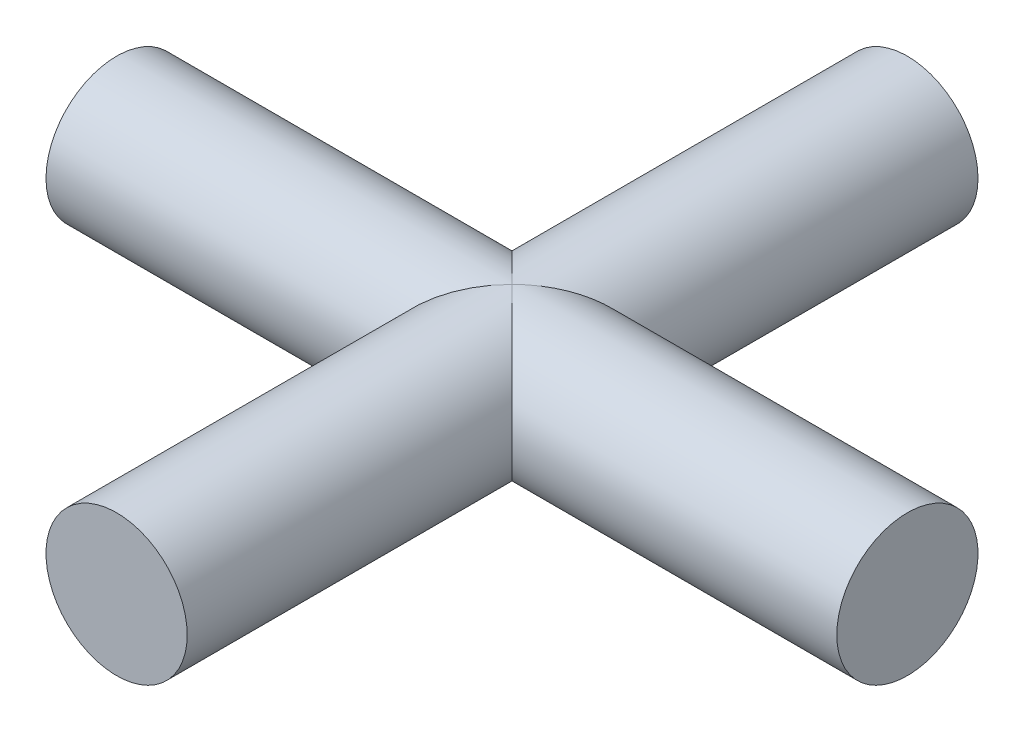
ISO-10303-21;
HEADER;
FILE_DESCRIPTION(('STEP AP214'),'2;1');
FILE_NAME('part.step','',(''),(''),'','','');
FILE_SCHEMA(('AUTOMOTIVE_DESIGN { 1 0 10303 214 1 1 1 1 }'));
ENDSEC;
DATA;
#1=APPLICATION_CONTEXT('core data for automotive mechanical design processes');
#2=APPLICATION_PROTOCOL_DEFINITION('international standard','automotive_design',2000,#1);
#3=PRODUCT_CONTEXT('',#1,'mechanical');
#4=PRODUCT('Part','Part','',(#3));
#5=PRODUCT_RELATED_PRODUCT_CATEGORY('part','',(#4));
#6=PRODUCT_DEFINITION_FORMATION('','',#4);
#7=PRODUCT_DEFINITION_CONTEXT('part definition',#1,'design');
#8=PRODUCT_DEFINITION('design','',#6,#7);
#9=PRODUCT_DEFINITION_SHAPE('','',#8);
#10=(LENGTH_UNIT() NAMED_UNIT(*) SI_UNIT(.MILLI.,.METRE.));
#11=(NAMED_UNIT(*) PLANE_ANGLE_UNIT() SI_UNIT($,.RADIAN.));
#12=(NAMED_UNIT(*) SI_UNIT($,.STERADIAN.) SOLID_ANGLE_UNIT());
#13=UNCERTAINTY_MEASURE_WITH_UNIT(LENGTH_MEASURE(1.E-05),#10,'distance_accuracy_value','');
#14=(GEOMETRIC_REPRESENTATION_CONTEXT(3) GLOBAL_UNCERTAINTY_ASSIGNED_CONTEXT((#13)) GLOBAL_UNIT_ASSIGNED_CONTEXT((#10,
#11,#12)) REPRESENTATION_CONTEXT('',''));
#15=CARTESIAN_POINT('',(0.,0.,0.));
#16=DIRECTION('',(0.,0.,1.));
#17=DIRECTION('',(1.,0.,0.));
#18=AXIS2_PLACEMENT_3D('',#15,#16,#17);
#19=CARTESIAN_POINT('',(0.,0.,14.));
#20=DIRECTION('',(0.,0.,-1.));
#21=DIRECTION('',(1.,0.,0.));
#22=AXIS2_PLACEMENT_3D('',#19,#20,#21);
#23=CYLINDRICAL_SURFACE('',#22,2.5);
#24=CARTESIAN_POINT('',(0.,0.,0.));
#25=DIRECTION('',(-0.707106781186548,0.,0.707106781186548));
#26=DIRECTION('',(-0.707106781186548,0.,-0.707106781186548));
#27=AXIS2_PLACEMENT_3D('',#24,#25,#26);
#28=ELLIPSE('',#27,3.53553390593274,2.5);
#29=CARTESIAN_POINT('',(0.,-2.5,0.));
#30=VERTEX_POINT('',#29);
#31=CARTESIAN_POINT('',(0.,2.5,0.));
#32=VERTEX_POINT('',#31);
#33=EDGE_CURVE('E53',#30,#32,#28,.T.);
#34=ORIENTED_EDGE('',*,*,#33,.T.);
#35=CARTESIAN_POINT('',(0.,0.,0.));
#36=DIRECTION('',(0.707106781186548,0.,0.707106781186548));
#37=DIRECTION('',(0.707106781186548,0.,-0.707106781186548));
#38=AXIS2_PLACEMENT_3D('',#35,#36,#37);
#39=ELLIPSE('',#38,3.53553390593274,2.5);
#40=EDGE_CURVE('E70',#32,#30,#39,.T.);
#41=ORIENTED_EDGE('',*,*,#40,.T.);
#42=EDGE_LOOP('',(#34,#41));
#43=FACE_BOUND('',#42,.T.);
#44=CARTESIAN_POINT('',(0.,0.,14.));
#45=DIRECTION('',(0.,0.,1.));
#46=DIRECTION('',(1.,0.,0.));
#47=AXIS2_PLACEMENT_3D('',#44,#45,#46);
#48=CIRCLE('',#47,2.5);
#49=CARTESIAN_POINT('',(2.5,0.,14.));
#50=VERTEX_POINT('',#49);
#51=EDGE_CURVE('E71',#50,#50,#48,.T.);
#52=ORIENTED_EDGE('',*,*,#51,.F.);
#53=EDGE_LOOP('',(#52));
#54=FACE_BOUND('',#53,.T.);
#55=ADVANCED_FACE('F45',(#43,#54),#23,.T.);
#56=CARTESIAN_POINT('',(0.,0.,14.));
#57=DIRECTION('',(0.,0.,-1.));
#58=DIRECTION('',(1.,0.,0.));
#59=AXIS2_PLACEMENT_3D('',#56,#57,#58);
#60=PLANE('',#59);
#61=ORIENTED_EDGE('',*,*,#51,.T.);
#62=EDGE_LOOP('',(#61));
#63=FACE_BOUND('',#62,.T.);
#64=ADVANCED_FACE('F100',(#63),#60,.F.);
#65=CARTESIAN_POINT('',(14.,0.,0.));
#66=DIRECTION('',(1.,0.,0.));
#67=DIRECTION('',(0.,0.,1.));
#68=AXIS2_PLACEMENT_3D('',#65,#66,#67);
#69=PLANE('',#68);
#70=CARTESIAN_POINT('',(14.,0.,0.));
#71=DIRECTION('',(-1.,0.,0.));
#72=DIRECTION('',(0.,0.,1.));
#73=AXIS2_PLACEMENT_3D('',#70,#71,#72);
#74=CIRCLE('',#73,2.5);
#75=CARTESIAN_POINT('',(14.,0.,2.5));
#76=VERTEX_POINT('',#75);
#77=EDGE_CURVE('E92',#76,#76,#74,.T.);
#78=ORIENTED_EDGE('',*,*,#77,.F.);
#79=EDGE_LOOP('',(#78));
#80=FACE_BOUND('',#79,.T.);
#81=ADVANCED_FACE('F98',(#80),#69,.T.);
#82=CARTESIAN_POINT('',(-14.,0.,0.));
#83=DIRECTION('',(1.,0.,0.));
#84=DIRECTION('',(0.,0.,1.));
#85=AXIS2_PLACEMENT_3D('',#82,#83,#84);
#86=CYLINDRICAL_SURFACE('',#85,2.5);
#87=ORIENTED_EDGE('',*,*,#77,.T.);
#88=EDGE_LOOP('',(#87));
#89=FACE_BOUND('',#88,.T.);
#90=CARTESIAN_POINT('',(0.,0.,0.));
#91=DIRECTION('',(0.707106781186548,0.,0.707106781186548));
#92=DIRECTION('',(0.707106781186548,0.,-0.707106781186548));
#93=AXIS2_PLACEMENT_3D('',#90,#91,#92);
#94=ELLIPSE('',#93,3.53553390593274,2.5);
#95=EDGE_CURVE('E63',#32,#30,#94,.F.);
#96=ORIENTED_EDGE('',*,*,#95,.F.);
#97=ORIENTED_EDGE('',*,*,#33,.F.);
#98=EDGE_LOOP('',(#96,#97));
#99=FACE_BOUND('',#98,.T.);
#100=ADVANCED_FACE('F67',(#89,#99),#86,.T.);
#101=CARTESIAN_POINT('',(0.,0.,-14.));
#102=DIRECTION('',(0.,0.,-1.));
#103=DIRECTION('',(1.,0.,0.));
#104=AXIS2_PLACEMENT_3D('',#101,#102,#103);
#105=PLANE('',#104);
#106=CARTESIAN_POINT('',(0.,0.,-14.));
#107=DIRECTION('',(0.,0.,1.));
#108=DIRECTION('',(1.,0.,0.));
#109=AXIS2_PLACEMENT_3D('',#106,#107,#108);
#110=CIRCLE('',#109,2.5);
#111=CARTESIAN_POINT('',(2.5,0.,-14.));
#112=VERTEX_POINT('',#111);
#113=EDGE_CURVE('E84',#112,#112,#110,.T.);
#114=ORIENTED_EDGE('',*,*,#113,.F.);
#115=EDGE_LOOP('',(#114));
#116=FACE_BOUND('',#115,.T.);
#117=ADVANCED_FACE('F106',(#116),#105,.T.);
#118=CARTESIAN_POINT('',(0.,0.,0.));
#119=DIRECTION('',(-0.707106781186548,0.,0.707106781186548));
#120=DIRECTION('',(-0.707106781186548,0.,-0.707106781186548));
#121=AXIS2_PLACEMENT_3D('',#118,#119,#120);
#122=ELLIPSE('',#121,3.53553390593274,2.5);
#123=EDGE_CURVE('E11',#30,#32,#122,.F.);
#124=ORIENTED_EDGE('',*,*,#123,.T.);
#125=ORIENTED_EDGE('',*,*,#95,.T.);
#126=EDGE_LOOP('',(#124,#125));
#127=FACE_BOUND('',#126,.T.);
#128=ORIENTED_EDGE('',*,*,#113,.T.);
#129=EDGE_LOOP('',(#128));
#130=FACE_BOUND('',#129,.T.);
#131=ADVANCED_FACE('F61',(#127,#130),#23,.T.);
#132=ORIENTED_EDGE('',*,*,#40,.F.);
#133=ORIENTED_EDGE('',*,*,#123,.F.);
#134=EDGE_LOOP('',(#132,#133));
#135=FACE_BOUND('',#134,.T.);
#136=CARTESIAN_POINT('',(-14.,0.,0.));
#137=DIRECTION('',(-1.,0.,0.));
#138=DIRECTION('',(0.,0.,1.));
#139=AXIS2_PLACEMENT_3D('',#136,#137,#138);
#140=CIRCLE('',#139,2.5);
#141=CARTESIAN_POINT('',(-14.,0.,2.5));
#142=VERTEX_POINT('',#141);
#143=EDGE_CURVE('E88',#142,#142,#140,.T.);
#144=ORIENTED_EDGE('',*,*,#143,.F.);
#145=EDGE_LOOP('',(#144));
#146=FACE_BOUND('',#145,.T.);
#147=ADVANCED_FACE('F73',(#135,#146),#86,.T.);
#148=CARTESIAN_POINT('',(-14.,0.,0.));
#149=DIRECTION('',(1.,0.,0.));
#150=DIRECTION('',(0.,0.,1.));
#151=AXIS2_PLACEMENT_3D('',#148,#149,#150);
#152=PLANE('',#151);
#153=ORIENTED_EDGE('',*,*,#143,.T.);
#154=EDGE_LOOP('',(#153));
#155=FACE_BOUND('',#154,.T.);
#156=ADVANCED_FACE('F118',(#155),#152,.F.);
#157=CLOSED_SHELL('',(#55,#64,#81,#100,#117,#131,#147,#156));
#158=MANIFOLD_SOLID_BREP('B2',#157);
#159=ADVANCED_BREP_SHAPE_REPRESENTATION('',(#18,#158),#14);
#160=SHAPE_DEFINITION_REPRESENTATION(#9,#159);
ENDSEC;
END-ISO-10303-21;
